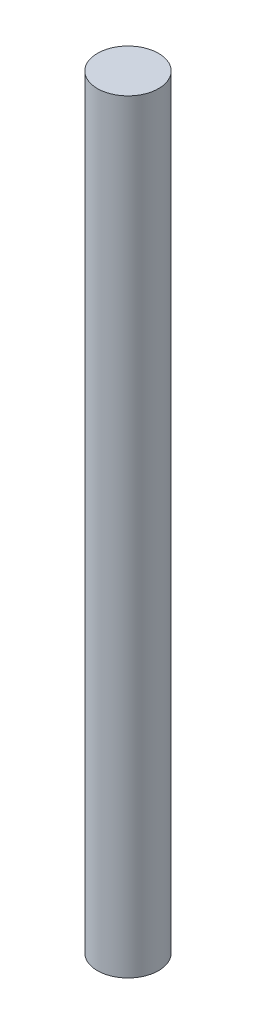
ISO-10303-21;
HEADER;
FILE_DESCRIPTION(('STEP AP214'),'2;1');
FILE_NAME('part.step','',(''),(''),'','','');
FILE_SCHEMA(('AUTOMOTIVE_DESIGN { 1 0 10303 214 1 1 1 1 }'));
ENDSEC;
DATA;
#1=APPLICATION_CONTEXT('core data for automotive mechanical design processes');
#2=APPLICATION_PROTOCOL_DEFINITION('international standard','automotive_design',2000,#1);
#3=PRODUCT_CONTEXT('',#1,'mechanical');
#4=PRODUCT('Part','Part','',(#3));
#5=PRODUCT_RELATED_PRODUCT_CATEGORY('part','',(#4));
#6=PRODUCT_DEFINITION_FORMATION('','',#4);
#7=PRODUCT_DEFINITION_CONTEXT('part definition',#1,'design');
#8=PRODUCT_DEFINITION('design','',#6,#7);
#9=PRODUCT_DEFINITION_SHAPE('','',#8);
#10=(LENGTH_UNIT() NAMED_UNIT(*) SI_UNIT(.MILLI.,.METRE.));
#11=(NAMED_UNIT(*) PLANE_ANGLE_UNIT() SI_UNIT($,.RADIAN.));
#12=(NAMED_UNIT(*) SI_UNIT($,.STERADIAN.) SOLID_ANGLE_UNIT());
#13=UNCERTAINTY_MEASURE_WITH_UNIT(LENGTH_MEASURE(1.E-05),#10,'distance_accuracy_value','');
#14=(GEOMETRIC_REPRESENTATION_CONTEXT(3) GLOBAL_UNCERTAINTY_ASSIGNED_CONTEXT((#13)) GLOBAL_UNIT_ASSIGNED_CONTEXT((#10,
#11,#12)) REPRESENTATION_CONTEXT('',''));
#15=CARTESIAN_POINT('',(0.,0.,0.));
#16=DIRECTION('',(0.,0.,1.));
#17=DIRECTION('',(1.,0.,0.));
#18=AXIS2_PLACEMENT_3D('',#15,#16,#17);
#19=CARTESIAN_POINT('',(0.,25.9999999999999,147.930368068259));
#20=DIRECTION('',(0.,1.,0.));
#21=DIRECTION('',(0.,0.,1.));
#22=AXIS2_PLACEMENT_3D('',#19,#20,#21);
#23=CYLINDRICAL_SURFACE('',#22,5.00000000000001);
#24=CARTESIAN_POINT('',(0.,25.9999999999999,147.930368068259));
#25=DIRECTION('',(0.,1.,0.));
#26=DIRECTION('',(0.,0.,1.));
#27=AXIS2_PLACEMENT_3D('',#24,#25,#26);
#28=CIRCLE('',#27,5.00000000000001);
#29=CARTESIAN_POINT('',(0.,25.9999999999999,152.930368068259));
#30=VERTEX_POINT('',#29);
#31=EDGE_CURVE('E10',#30,#30,#28,.T.);
#32=ORIENTED_EDGE('',*,*,#31,.T.);
#33=EDGE_LOOP('',(#32));
#34=FACE_BOUND('',#33,.T.);
#35=CARTESIAN_POINT('',(0.,151.,147.930368068259));
#36=DIRECTION('',(0.,1.,0.));
#37=DIRECTION('',(0.,0.,1.));
#38=AXIS2_PLACEMENT_3D('',#35,#36,#37);
#39=CIRCLE('',#38,5.00000000000001);
#40=CARTESIAN_POINT('',(0.,151.,152.930368068259));
#41=VERTEX_POINT('',#40);
#42=EDGE_CURVE('E45',#41,#41,#39,.T.);
#43=ORIENTED_EDGE('',*,*,#42,.F.);
#44=EDGE_LOOP('',(#43));
#45=FACE_BOUND('',#44,.T.);
#46=ADVANCED_FACE('F39',(#34,#45),#23,.T.);
#47=CARTESIAN_POINT('',(0.,25.9999999999999,147.930368068259));
#48=DIRECTION('',(0.,1.,0.));
#49=DIRECTION('',(0.,0.,1.));
#50=AXIS2_PLACEMENT_3D('',#47,#48,#49);
#51=PLANE('',#50);
#52=ORIENTED_EDGE('',*,*,#31,.F.);
#53=EDGE_LOOP('',(#52));
#54=FACE_BOUND('',#53,.T.);
#55=ADVANCED_FACE('F54',(#54),#51,.F.);
#56=CARTESIAN_POINT('',(0.,151.,147.930368068259));
#57=DIRECTION('',(0.,1.,0.));
#58=DIRECTION('',(0.,0.,1.));
#59=AXIS2_PLACEMENT_3D('',#56,#57,#58);
#60=PLANE('',#59);
#61=ORIENTED_EDGE('',*,*,#42,.T.);
#62=EDGE_LOOP('',(#61));
#63=FACE_BOUND('',#62,.T.);
#64=ADVANCED_FACE('F51',(#63),#60,.T.);
#65=CLOSED_SHELL('',(#46,#55,#64));
#66=MANIFOLD_SOLID_BREP('B2',#65);
#67=ADVANCED_BREP_SHAPE_REPRESENTATION('',(#18,#66),#14);
#68=SHAPE_DEFINITION_REPRESENTATION(#9,#67);
ENDSEC;
END-ISO-10303-21;
